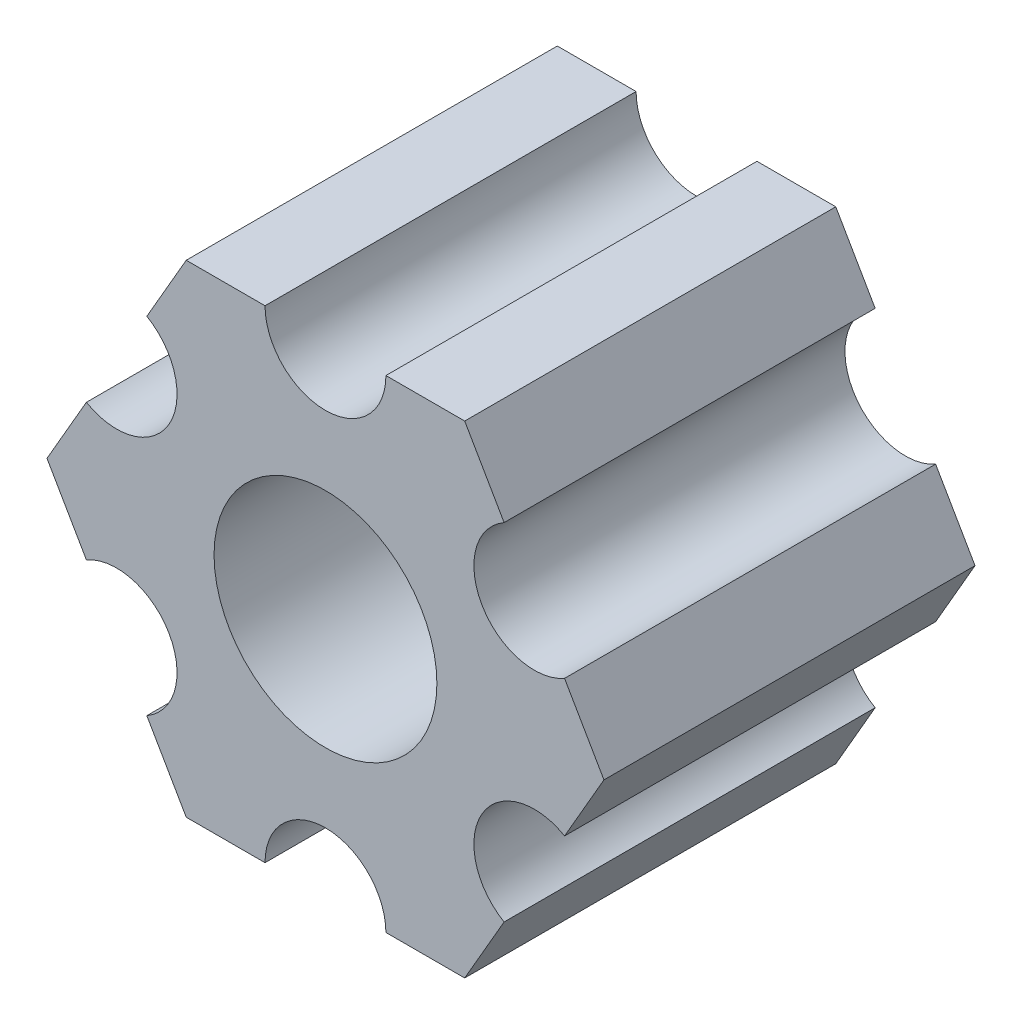
ISO-10303-21;
HEADER;
FILE_DESCRIPTION(('STEP AP214'),'2;1');
FILE_NAME('part.step','',(''),(''),'','','');
FILE_SCHEMA(('AUTOMOTIVE_DESIGN { 1 0 10303 214 1 1 1 1 }'));
ENDSEC;
DATA;
#1=APPLICATION_CONTEXT('core data for automotive mechanical design processes');
#2=APPLICATION_PROTOCOL_DEFINITION('international standard','automotive_design',2000,#1);
#3=PRODUCT_CONTEXT('',#1,'mechanical');
#4=PRODUCT('Part','Part','',(#3));
#5=PRODUCT_RELATED_PRODUCT_CATEGORY('part','',(#4));
#6=PRODUCT_DEFINITION_FORMATION('','',#4);
#7=PRODUCT_DEFINITION_CONTEXT('part definition',#1,'design');
#8=PRODUCT_DEFINITION('design','',#6,#7);
#9=PRODUCT_DEFINITION_SHAPE('','',#8);
#10=(LENGTH_UNIT() NAMED_UNIT(*) SI_UNIT(.MILLI.,.METRE.));
#11=(NAMED_UNIT(*) PLANE_ANGLE_UNIT() SI_UNIT($,.RADIAN.));
#12=(NAMED_UNIT(*) SI_UNIT($,.STERADIAN.) SOLID_ANGLE_UNIT());
#13=UNCERTAINTY_MEASURE_WITH_UNIT(LENGTH_MEASURE(1.E-05),#10,'distance_accuracy_value','');
#14=(GEOMETRIC_REPRESENTATION_CONTEXT(3) GLOBAL_UNCERTAINTY_ASSIGNED_CONTEXT((#13)) GLOBAL_UNIT_ASSIGNED_CONTEXT((#10,
#11,#12)) REPRESENTATION_CONTEXT('',''));
#15=CARTESIAN_POINT('',(0.,0.,0.));
#16=DIRECTION('',(0.,0.,1.));
#17=DIRECTION('',(1.,0.,0.));
#18=AXIS2_PLACEMENT_3D('',#15,#16,#17);
#19=CARTESIAN_POINT('',(5.49926131403118,-3.175,9.77));
#20=DIRECTION('',(0.,0.,-1.));
#21=DIRECTION('',(-1.,0.,0.));
#22=AXIS2_PLACEMENT_3D('',#19,#20,#21);
#23=CYLINDRICAL_SURFACE('',#22,1.59130995915342);
#24=CARTESIAN_POINT('',(5.49926131403118,-3.175,0.));
#25=DIRECTION('',(0.,0.,1.));
#26=DIRECTION('',(1.,0.,0.));
#27=AXIS2_PLACEMENT_3D('',#24,#25,#26);
#28=CIRCLE('',#27,1.59130995915342);
#29=CARTESIAN_POINT('',(6.2949162936079,-1.79688515007796,0.));
#30=VERTEX_POINT('',#29);
#31=CARTESIAN_POINT('',(4.70360633445448,-4.55311484992204,0.));
#32=VERTEX_POINT('',#31);
#33=EDGE_CURVE('E202',#30,#32,#28,.T.);
#34=ORIENTED_EDGE('',*,*,#33,.F.);
#35=DIRECTION('',(0.,0.,-1.));
#36=VECTOR('',#35,1.);
#37=CARTESIAN_POINT('',(6.2949162936079,-1.79688515007796,9.77));
#38=LINE('',#37,#36);
#39=CARTESIAN_POINT('',(6.2949162936079,-1.79688515007796,9.77));
#40=VERTEX_POINT('',#39);
#41=EDGE_CURVE('E13',#40,#30,#38,.T.);
#42=ORIENTED_EDGE('',*,*,#41,.F.);
#43=CARTESIAN_POINT('',(5.49926131403118,-3.175,9.77));
#44=DIRECTION('',(0.,0.,1.));
#45=DIRECTION('',(1.,0.,0.));
#46=AXIS2_PLACEMENT_3D('',#43,#44,#45);
#47=CIRCLE('',#46,1.59130995915342);
#48=CARTESIAN_POINT('',(4.70360633445448,-4.55311484992204,9.77));
#49=VERTEX_POINT('',#48);
#50=EDGE_CURVE('E253',#40,#49,#47,.T.);
#51=ORIENTED_EDGE('',*,*,#50,.T.);
#52=DIRECTION('',(0.,0.,-1.));
#53=VECTOR('',#52,1.);
#54=CARTESIAN_POINT('',(4.70360633445448,-4.55311484992204,9.77));
#55=LINE('',#54,#53);
#56=EDGE_CURVE('E48',#49,#32,#55,.T.);
#57=ORIENTED_EDGE('',*,*,#56,.T.);
#58=EDGE_LOOP('',(#34,#42,#51,#57));
#59=FACE_BOUND('',#58,.T.);
#60=ADVANCED_FACE('F45',(#59),#23,.F.);
#61=CARTESIAN_POINT('',(7.33234841870824,0.,9.77));
#62=DIRECTION('',(0.866025403784439,-0.499999999999999,0.));
#63=DIRECTION('',(0.499999999999999,0.866025403784439,0.));
#64=AXIS2_PLACEMENT_3D('',#61,#62,#63);
#65=PLANE('',#64);
#66=DIRECTION('',(-0.499999999999999,-0.866025403784439,0.));
#67=VECTOR('',#66,1.);
#68=CARTESIAN_POINT('',(7.33234841870824,0.,0.));
#69=LINE('',#68,#67);
#70=CARTESIAN_POINT('',(7.33234841870824,0.,0.));
#71=VERTEX_POINT('',#70);
#72=EDGE_CURVE('E251',#71,#30,#69,.T.);
#73=ORIENTED_EDGE('',*,*,#72,.F.);
#74=DIRECTION('',(0.,0.,-1.));
#75=VECTOR('',#74,1.);
#76=CARTESIAN_POINT('',(7.33234841870824,0.,9.77));
#77=LINE('',#76,#75);
#78=CARTESIAN_POINT('',(7.33234841870824,0.,9.77));
#79=VERTEX_POINT('',#78);
#80=EDGE_CURVE('E54',#79,#71,#77,.T.);
#81=ORIENTED_EDGE('',*,*,#80,.F.);
#82=DIRECTION('',(-0.499999999999999,-0.866025403784439,0.));
#83=VECTOR('',#82,1.);
#84=CARTESIAN_POINT('',(7.33234841870824,0.,9.77));
#85=LINE('',#84,#83);
#86=EDGE_CURVE('E192',#79,#40,#85,.T.);
#87=ORIENTED_EDGE('',*,*,#86,.T.);
#88=ORIENTED_EDGE('',*,*,#41,.T.);
#89=EDGE_LOOP('',(#73,#81,#87,#88));
#90=FACE_BOUND('',#89,.T.);
#91=ADVANCED_FACE('F285',(#90),#65,.T.);
#92=CARTESIAN_POINT('',(6.2949162936079,1.79688515007796,9.77));
#93=DIRECTION('',(0.866025403784439,0.499999999999999,0.));
#94=DIRECTION('',(-0.499999999999999,0.866025403784439,0.));
#95=AXIS2_PLACEMENT_3D('',#92,#93,#94);
#96=PLANE('',#95);
#97=DIRECTION('',(0.499999999999999,-0.866025403784439,0.));
#98=VECTOR('',#97,1.);
#99=CARTESIAN_POINT('',(6.2949162936079,1.79688515007796,0.));
#100=LINE('',#99,#98);
#101=CARTESIAN_POINT('',(6.2949162936079,1.79688515007796,0.));
#102=VERTEX_POINT('',#101);
#103=EDGE_CURVE('E179',#102,#71,#100,.T.);
#104=ORIENTED_EDGE('',*,*,#103,.F.);
#105=DIRECTION('',(0.,0.,-1.));
#106=VECTOR('',#105,1.);
#107=CARTESIAN_POINT('',(6.2949162936079,1.79688515007796,9.77));
#108=LINE('',#107,#106);
#109=CARTESIAN_POINT('',(6.2949162936079,1.79688515007796,9.77));
#110=VERTEX_POINT('',#109);
#111=EDGE_CURVE('E174',#110,#102,#108,.T.);
#112=ORIENTED_EDGE('',*,*,#111,.F.);
#113=DIRECTION('',(0.499999999999999,-0.866025403784439,0.));
#114=VECTOR('',#113,1.);
#115=CARTESIAN_POINT('',(6.2949162936079,1.79688515007796,9.77));
#116=LINE('',#115,#114);
#117=EDGE_CURVE('E177',#110,#79,#116,.T.);
#118=ORIENTED_EDGE('',*,*,#117,.T.);
#119=ORIENTED_EDGE('',*,*,#80,.T.);
#120=EDGE_LOOP('',(#104,#112,#118,#119));
#121=FACE_BOUND('',#120,.T.);
#122=ADVANCED_FACE('F176',(#121),#96,.T.);
#123=CARTESIAN_POINT('',(5.49926131403119,3.175,9.77));
#124=DIRECTION('',(0.,0.,-1.));
#125=DIRECTION('',(-1.,0.,0.));
#126=AXIS2_PLACEMENT_3D('',#123,#124,#125);
#127=CYLINDRICAL_SURFACE('',#126,1.59130995915342);
#128=CARTESIAN_POINT('',(5.49926131403119,3.175,0.));
#129=DIRECTION('',(0.,0.,1.));
#130=DIRECTION('',(1.,0.,0.));
#131=AXIS2_PLACEMENT_3D('',#128,#129,#130);
#132=CIRCLE('',#131,1.59130995915342);
#133=CARTESIAN_POINT('',(4.70360633445448,4.55311484992204,0.));
#134=VERTEX_POINT('',#133);
#135=EDGE_CURVE('E248',#134,#102,#132,.T.);
#136=ORIENTED_EDGE('',*,*,#135,.F.);
#137=DIRECTION('',(0.,0.,-1.));
#138=VECTOR('',#137,1.);
#139=CARTESIAN_POINT('',(4.70360633445448,4.55311484992204,9.77));
#140=LINE('',#139,#138);
#141=CARTESIAN_POINT('',(4.70360633445448,4.55311484992204,9.77));
#142=VERTEX_POINT('',#141);
#143=EDGE_CURVE('E184',#142,#134,#140,.T.);
#144=ORIENTED_EDGE('',*,*,#143,.F.);
#145=CARTESIAN_POINT('',(5.49926131403119,3.175,9.77));
#146=DIRECTION('',(0.,0.,1.));
#147=DIRECTION('',(1.,0.,0.));
#148=AXIS2_PLACEMENT_3D('',#145,#146,#147);
#149=CIRCLE('',#148,1.59130995915342);
#150=EDGE_CURVE('E190',#142,#110,#149,.T.);
#151=ORIENTED_EDGE('',*,*,#150,.T.);
#152=ORIENTED_EDGE('',*,*,#111,.T.);
#153=EDGE_LOOP('',(#136,#144,#151,#152));
#154=FACE_BOUND('',#153,.T.);
#155=ADVANCED_FACE('F194',(#154),#127,.F.);
#156=CARTESIAN_POINT('',(3.66617420935412,6.35,9.77));
#157=DIRECTION('',(0.866025403784438,0.5,0.));
#158=DIRECTION('',(-0.5,0.866025403784438,0.));
#159=AXIS2_PLACEMENT_3D('',#156,#157,#158);
#160=PLANE('',#159);
#161=DIRECTION('',(0.5,-0.866025403784438,0.));
#162=VECTOR('',#161,1.);
#163=CARTESIAN_POINT('',(3.66617420935412,6.35,0.));
#164=LINE('',#163,#162);
#165=CARTESIAN_POINT('',(3.66617420935412,6.35,0.));
#166=VERTEX_POINT('',#165);
#167=EDGE_CURVE('E245',#166,#134,#164,.T.);
#168=ORIENTED_EDGE('',*,*,#167,.F.);
#169=DIRECTION('',(0.,0.,-1.));
#170=VECTOR('',#169,1.);
#171=CARTESIAN_POINT('',(3.66617420935412,6.35,9.77));
#172=LINE('',#171,#170);
#173=CARTESIAN_POINT('',(3.66617420935412,6.35,9.77));
#174=VERTEX_POINT('',#173);
#175=EDGE_CURVE('E257',#174,#166,#172,.T.);
#176=ORIENTED_EDGE('',*,*,#175,.F.);
#177=DIRECTION('',(0.5,-0.866025403784438,0.));
#178=VECTOR('',#177,1.);
#179=CARTESIAN_POINT('',(3.66617420935412,6.35,9.77));
#180=LINE('',#179,#178);
#181=EDGE_CURVE('E195',#174,#142,#180,.T.);
#182=ORIENTED_EDGE('',*,*,#181,.T.);
#183=ORIENTED_EDGE('',*,*,#143,.T.);
#184=EDGE_LOOP('',(#168,#176,#182,#183));
#185=FACE_BOUND('',#184,.T.);
#186=ADVANCED_FACE('F298',(#185),#160,.T.);
#187=CARTESIAN_POINT('',(1.59130995915343,6.35,9.77));
#188=DIRECTION('',(0.,1.,0.));
#189=DIRECTION('',(0.,0.,1.));
#190=AXIS2_PLACEMENT_3D('',#187,#188,#189);
#191=PLANE('',#190);
#192=DIRECTION('',(1.,0.,0.));
#193=VECTOR('',#192,1.);
#194=CARTESIAN_POINT('',(1.59130995915343,6.35,0.));
#195=LINE('',#194,#193);
#196=CARTESIAN_POINT('',(1.59130995915343,6.35,0.));
#197=VERTEX_POINT('',#196);
#198=EDGE_CURVE('E242',#197,#166,#195,.T.);
#199=ORIENTED_EDGE('',*,*,#198,.F.);
#200=DIRECTION('',(0.,0.,-1.));
#201=VECTOR('',#200,1.);
#202=CARTESIAN_POINT('',(1.59130995915343,6.35,9.77));
#203=LINE('',#202,#201);
#204=CARTESIAN_POINT('',(1.59130995915343,6.35,9.77));
#205=VERTEX_POINT('',#204);
#206=EDGE_CURVE('E259',#205,#197,#203,.T.);
#207=ORIENTED_EDGE('',*,*,#206,.F.);
#208=DIRECTION('',(1.,0.,0.));
#209=VECTOR('',#208,1.);
#210=CARTESIAN_POINT('',(1.59130995915343,6.35,9.77));
#211=LINE('',#210,#209);
#212=EDGE_CURVE('E197',#205,#174,#211,.T.);
#213=ORIENTED_EDGE('',*,*,#212,.T.);
#214=ORIENTED_EDGE('',*,*,#175,.T.);
#215=EDGE_LOOP('',(#199,#207,#213,#214));
#216=FACE_BOUND('',#215,.T.);
#217=ADVANCED_FACE('F301',(#216),#191,.T.);
#218=CARTESIAN_POINT('',(0.,6.35,9.77));
#219=DIRECTION('',(0.,0.,-1.));
#220=DIRECTION('',(-1.,0.,0.));
#221=AXIS2_PLACEMENT_3D('',#218,#219,#220);
#222=CYLINDRICAL_SURFACE('',#221,1.59130995915342);
#223=CARTESIAN_POINT('',(0.,6.35,0.));
#224=DIRECTION('',(0.,0.,1.));
#225=DIRECTION('',(1.,0.,0.));
#226=AXIS2_PLACEMENT_3D('',#223,#224,#225);
#227=CIRCLE('',#226,1.59130995915342);
#228=CARTESIAN_POINT('',(-1.59130995915342,6.35,0.));
#229=VERTEX_POINT('',#228);
#230=EDGE_CURVE('E239',#229,#197,#227,.T.);
#231=ORIENTED_EDGE('',*,*,#230,.F.);
#232=DIRECTION('',(0.,0.,-1.));
#233=VECTOR('',#232,1.);
#234=CARTESIAN_POINT('',(-1.59130995915342,6.35,9.77));
#235=LINE('',#234,#233);
#236=CARTESIAN_POINT('',(-1.59130995915342,6.35,9.77));
#237=VERTEX_POINT('',#236);
#238=EDGE_CURVE('E261',#237,#229,#235,.T.);
#239=ORIENTED_EDGE('',*,*,#238,.F.);
#240=CARTESIAN_POINT('',(0.,6.35,9.77));
#241=DIRECTION('',(0.,0.,1.));
#242=DIRECTION('',(1.,0.,0.));
#243=AXIS2_PLACEMENT_3D('',#240,#241,#242);
#244=CIRCLE('',#243,1.59130995915342);
#245=EDGE_CURVE('E406',#237,#205,#244,.T.);
#246=ORIENTED_EDGE('',*,*,#245,.T.);
#247=ORIENTED_EDGE('',*,*,#206,.T.);
#248=EDGE_LOOP('',(#231,#239,#246,#247));
#249=FACE_BOUND('',#248,.T.);
#250=ADVANCED_FACE('F305',(#249),#222,.F.);
#251=CARTESIAN_POINT('',(-3.66617420935413,6.35,9.77));
#252=DIRECTION('',(0.,1.,0.));
#253=DIRECTION('',(0.,0.,1.));
#254=AXIS2_PLACEMENT_3D('',#251,#252,#253);
#255=PLANE('',#254);
#256=DIRECTION('',(1.,0.,0.));
#257=VECTOR('',#256,1.);
#258=CARTESIAN_POINT('',(-3.66617420935413,6.35,0.));
#259=LINE('',#258,#257);
#260=CARTESIAN_POINT('',(-3.66617420935413,6.35,0.));
#261=VERTEX_POINT('',#260);
#262=EDGE_CURVE('E236',#261,#229,#259,.T.);
#263=ORIENTED_EDGE('',*,*,#262,.F.);
#264=DIRECTION('',(0.,0.,-1.));
#265=VECTOR('',#264,1.);
#266=CARTESIAN_POINT('',(-3.66617420935413,6.35,9.77));
#267=LINE('',#266,#265);
#268=CARTESIAN_POINT('',(-3.66617420935413,6.35,9.77));
#269=VERTEX_POINT('',#268);
#270=EDGE_CURVE('E263',#269,#261,#267,.T.);
#271=ORIENTED_EDGE('',*,*,#270,.F.);
#272=DIRECTION('',(1.,0.,0.));
#273=VECTOR('',#272,1.);
#274=CARTESIAN_POINT('',(-3.66617420935413,6.35,9.77));
#275=LINE('',#274,#273);
#276=EDGE_CURVE('E403',#269,#237,#275,.T.);
#277=ORIENTED_EDGE('',*,*,#276,.T.);
#278=ORIENTED_EDGE('',*,*,#238,.T.);
#279=EDGE_LOOP('',(#263,#271,#277,#278));
#280=FACE_BOUND('',#279,.T.);
#281=ADVANCED_FACE('F309',(#280),#255,.T.);
#282=CARTESIAN_POINT('',(-4.70360633445447,4.55311484992205,9.77));
#283=DIRECTION('',(-0.866025403784439,0.5,0.));
#284=DIRECTION('',(-0.5,-0.866025403784439,0.));
#285=AXIS2_PLACEMENT_3D('',#282,#283,#284);
#286=PLANE('',#285);
#287=DIRECTION('',(0.5,0.866025403784439,0.));
#288=VECTOR('',#287,1.);
#289=CARTESIAN_POINT('',(-4.70360633445447,4.55311484992205,0.));
#290=LINE('',#289,#288);
#291=CARTESIAN_POINT('',(-4.70360633445447,4.55311484992205,0.));
#292=VERTEX_POINT('',#291);
#293=EDGE_CURVE('E233',#292,#261,#290,.T.);
#294=ORIENTED_EDGE('',*,*,#293,.F.);
#295=DIRECTION('',(0.,0.,-1.));
#296=VECTOR('',#295,1.);
#297=CARTESIAN_POINT('',(-4.70360633445447,4.55311484992205,9.77));
#298=LINE('',#297,#296);
#299=CARTESIAN_POINT('',(-4.70360633445447,4.55311484992205,9.77));
#300=VERTEX_POINT('',#299);
#301=EDGE_CURVE('E265',#300,#292,#298,.T.);
#302=ORIENTED_EDGE('',*,*,#301,.F.);
#303=DIRECTION('',(0.5,0.866025403784439,0.));
#304=VECTOR('',#303,1.);
#305=CARTESIAN_POINT('',(-4.70360633445447,4.55311484992205,9.77));
#306=LINE('',#305,#304);
#307=EDGE_CURVE('E400',#300,#269,#306,.T.);
#308=ORIENTED_EDGE('',*,*,#307,.T.);
#309=ORIENTED_EDGE('',*,*,#270,.T.);
#310=EDGE_LOOP('',(#294,#302,#308,#309));
#311=FACE_BOUND('',#310,.T.);
#312=ADVANCED_FACE('F313',(#311),#286,.T.);
#313=CARTESIAN_POINT('',(-5.49926131403118,3.175,9.77));
#314=DIRECTION('',(0.,0.,-1.));
#315=DIRECTION('',(-1.,0.,0.));
#316=AXIS2_PLACEMENT_3D('',#313,#314,#315);
#317=CYLINDRICAL_SURFACE('',#316,1.59130995915342);
#318=CARTESIAN_POINT('',(-5.49926131403118,3.175,0.));
#319=DIRECTION('',(0.,0.,1.));
#320=DIRECTION('',(1.,0.,0.));
#321=AXIS2_PLACEMENT_3D('',#318,#319,#320);
#322=CIRCLE('',#321,1.59130995915342);
#323=CARTESIAN_POINT('',(-6.29491629360789,1.79688515007796,0.));
#324=VERTEX_POINT('',#323);
#325=EDGE_CURVE('E230',#324,#292,#322,.T.);
#326=ORIENTED_EDGE('',*,*,#325,.F.);
#327=DIRECTION('',(0.,0.,-1.));
#328=VECTOR('',#327,1.);
#329=CARTESIAN_POINT('',(-6.29491629360789,1.79688515007796,9.77));
#330=LINE('',#329,#328);
#331=CARTESIAN_POINT('',(-6.29491629360789,1.79688515007796,9.77));
#332=VERTEX_POINT('',#331);
#333=EDGE_CURVE('E267',#332,#324,#330,.T.);
#334=ORIENTED_EDGE('',*,*,#333,.F.);
#335=CARTESIAN_POINT('',(-5.49926131403118,3.175,9.77));
#336=DIRECTION('',(0.,0.,1.));
#337=DIRECTION('',(1.,0.,0.));
#338=AXIS2_PLACEMENT_3D('',#335,#336,#337);
#339=CIRCLE('',#338,1.59130995915342);
#340=EDGE_CURVE('E397',#332,#300,#339,.T.);
#341=ORIENTED_EDGE('',*,*,#340,.T.);
#342=ORIENTED_EDGE('',*,*,#301,.T.);
#343=EDGE_LOOP('',(#326,#334,#341,#342));
#344=FACE_BOUND('',#343,.T.);
#345=ADVANCED_FACE('F317',(#344),#317,.F.);
#346=CARTESIAN_POINT('',(-7.33234841870825,0.,9.77));
#347=DIRECTION('',(-0.866025403784438,0.5,0.));
#348=DIRECTION('',(-0.5,-0.866025403784438,0.));
#349=AXIS2_PLACEMENT_3D('',#346,#347,#348);
#350=PLANE('',#349);
#351=DIRECTION('',(0.5,0.866025403784438,0.));
#352=VECTOR('',#351,1.);
#353=CARTESIAN_POINT('',(-7.33234841870825,0.,0.));
#354=LINE('',#353,#352);
#355=CARTESIAN_POINT('',(-7.33234841870825,0.,0.));
#356=VERTEX_POINT('',#355);
#357=EDGE_CURVE('E227',#356,#324,#354,.T.);
#358=ORIENTED_EDGE('',*,*,#357,.F.);
#359=DIRECTION('',(0.,0.,-1.));
#360=VECTOR('',#359,1.);
#361=CARTESIAN_POINT('',(-7.33234841870825,0.,9.77));
#362=LINE('',#361,#360);
#363=CARTESIAN_POINT('',(-7.33234841870825,0.,9.77));
#364=VERTEX_POINT('',#363);
#365=EDGE_CURVE('E269',#364,#356,#362,.T.);
#366=ORIENTED_EDGE('',*,*,#365,.F.);
#367=DIRECTION('',(0.5,0.866025403784438,0.));
#368=VECTOR('',#367,1.);
#369=CARTESIAN_POINT('',(-7.33234841870825,0.,9.77));
#370=LINE('',#369,#368);
#371=EDGE_CURVE('E394',#364,#332,#370,.T.);
#372=ORIENTED_EDGE('',*,*,#371,.T.);
#373=ORIENTED_EDGE('',*,*,#333,.T.);
#374=EDGE_LOOP('',(#358,#366,#372,#373));
#375=FACE_BOUND('',#374,.T.);
#376=ADVANCED_FACE('F321',(#375),#350,.T.);
#377=CARTESIAN_POINT('',(-6.2949162936079,-1.79688515007796,9.77));
#378=DIRECTION('',(-0.866025403784439,-0.5,0.));
#379=DIRECTION('',(0.5,-0.866025403784439,0.));
#380=AXIS2_PLACEMENT_3D('',#377,#378,#379);
#381=PLANE('',#380);
#382=DIRECTION('',(-0.5,0.866025403784439,0.));
#383=VECTOR('',#382,1.);
#384=CARTESIAN_POINT('',(-6.2949162936079,-1.79688515007796,0.));
#385=LINE('',#384,#383);
#386=CARTESIAN_POINT('',(-6.2949162936079,-1.79688515007796,0.));
#387=VERTEX_POINT('',#386);
#388=EDGE_CURVE('E224',#387,#356,#385,.T.);
#389=ORIENTED_EDGE('',*,*,#388,.F.);
#390=DIRECTION('',(0.,0.,-1.));
#391=VECTOR('',#390,1.);
#392=CARTESIAN_POINT('',(-6.2949162936079,-1.79688515007796,9.77));
#393=LINE('',#392,#391);
#394=CARTESIAN_POINT('',(-6.2949162936079,-1.79688515007796,9.77));
#395=VERTEX_POINT('',#394);
#396=EDGE_CURVE('E271',#395,#387,#393,.T.);
#397=ORIENTED_EDGE('',*,*,#396,.F.);
#398=DIRECTION('',(-0.5,0.866025403784439,0.));
#399=VECTOR('',#398,1.);
#400=CARTESIAN_POINT('',(-6.2949162936079,-1.79688515007796,9.77));
#401=LINE('',#400,#399);
#402=EDGE_CURVE('E391',#395,#364,#401,.T.);
#403=ORIENTED_EDGE('',*,*,#402,.T.);
#404=ORIENTED_EDGE('',*,*,#365,.T.);
#405=EDGE_LOOP('',(#389,#397,#403,#404));
#406=FACE_BOUND('',#405,.T.);
#407=ADVANCED_FACE('F325',(#406),#381,.T.);
#408=CARTESIAN_POINT('',(-5.49926131403119,-3.175,9.77));
#409=DIRECTION('',(0.,0.,-1.));
#410=DIRECTION('',(-1.,0.,0.));
#411=AXIS2_PLACEMENT_3D('',#408,#409,#410);
#412=CYLINDRICAL_SURFACE('',#411,1.59130995915342);
#413=CARTESIAN_POINT('',(-5.49926131403119,-3.175,0.));
#414=DIRECTION('',(0.,0.,1.));
#415=DIRECTION('',(1.,0.,0.));
#416=AXIS2_PLACEMENT_3D('',#413,#414,#415);
#417=CIRCLE('',#416,1.59130995915342);
#418=CARTESIAN_POINT('',(-4.70360633445448,-4.55311484992204,0.));
#419=VERTEX_POINT('',#418);
#420=EDGE_CURVE('E221',#419,#387,#417,.T.);
#421=ORIENTED_EDGE('',*,*,#420,.F.);
#422=DIRECTION('',(0.,0.,-1.));
#423=VECTOR('',#422,1.);
#424=CARTESIAN_POINT('',(-4.70360633445448,-4.55311484992204,9.77));
#425=LINE('',#424,#423);
#426=CARTESIAN_POINT('',(-4.70360633445448,-4.55311484992204,9.77));
#427=VERTEX_POINT('',#426);
#428=EDGE_CURVE('E273',#427,#419,#425,.T.);
#429=ORIENTED_EDGE('',*,*,#428,.F.);
#430=CARTESIAN_POINT('',(-5.49926131403119,-3.175,9.77));
#431=DIRECTION('',(0.,0.,1.));
#432=DIRECTION('',(1.,0.,0.));
#433=AXIS2_PLACEMENT_3D('',#430,#431,#432);
#434=CIRCLE('',#433,1.59130995915342);
#435=EDGE_CURVE('E388',#427,#395,#434,.T.);
#436=ORIENTED_EDGE('',*,*,#435,.T.);
#437=ORIENTED_EDGE('',*,*,#396,.T.);
#438=EDGE_LOOP('',(#421,#429,#436,#437));
#439=FACE_BOUND('',#438,.T.);
#440=ADVANCED_FACE('F329',(#439),#412,.F.);
#441=CARTESIAN_POINT('',(-3.66617420935412,-6.35,9.77));
#442=DIRECTION('',(-0.866025403784439,-0.5,0.));
#443=DIRECTION('',(0.5,-0.866025403784439,0.));
#444=AXIS2_PLACEMENT_3D('',#441,#442,#443);
#445=PLANE('',#444);
#446=DIRECTION('',(-0.5,0.866025403784439,0.));
#447=VECTOR('',#446,1.);
#448=CARTESIAN_POINT('',(-3.66617420935412,-6.35,0.));
#449=LINE('',#448,#447);
#450=CARTESIAN_POINT('',(-3.66617420935412,-6.35,0.));
#451=VERTEX_POINT('',#450);
#452=EDGE_CURVE('E218',#451,#419,#449,.T.);
#453=ORIENTED_EDGE('',*,*,#452,.F.);
#454=DIRECTION('',(0.,0.,-1.));
#455=VECTOR('',#454,1.);
#456=CARTESIAN_POINT('',(-3.66617420935412,-6.35,9.77));
#457=LINE('',#456,#455);
#458=CARTESIAN_POINT('',(-3.66617420935412,-6.35,9.77));
#459=VERTEX_POINT('',#458);
#460=EDGE_CURVE('E275',#459,#451,#457,.T.);
#461=ORIENTED_EDGE('',*,*,#460,.F.);
#462=DIRECTION('',(-0.5,0.866025403784439,0.));
#463=VECTOR('',#462,1.);
#464=CARTESIAN_POINT('',(-3.66617420935412,-6.35,9.77));
#465=LINE('',#464,#463);
#466=EDGE_CURVE('E385',#459,#427,#465,.T.);
#467=ORIENTED_EDGE('',*,*,#466,.T.);
#468=ORIENTED_EDGE('',*,*,#428,.T.);
#469=EDGE_LOOP('',(#453,#461,#467,#468));
#470=FACE_BOUND('',#469,.T.);
#471=ADVANCED_FACE('F333',(#470),#445,.T.);
#472=CARTESIAN_POINT('',(-1.59130995915342,-6.35,9.77));
#473=DIRECTION('',(0.,-1.,0.));
#474=DIRECTION('',(0.,0.,-1.));
#475=AXIS2_PLACEMENT_3D('',#472,#473,#474);
#476=PLANE('',#475);
#477=DIRECTION('',(-1.,0.,0.));
#478=VECTOR('',#477,1.);
#479=CARTESIAN_POINT('',(-1.59130995915342,-6.35,0.));
#480=LINE('',#479,#478);
#481=CARTESIAN_POINT('',(-1.59130995915342,-6.35,0.));
#482=VERTEX_POINT('',#481);
#483=EDGE_CURVE('E215',#482,#451,#480,.T.);
#484=ORIENTED_EDGE('',*,*,#483,.F.);
#485=DIRECTION('',(0.,0.,-1.));
#486=VECTOR('',#485,1.);
#487=CARTESIAN_POINT('',(-1.59130995915342,-6.35,9.77));
#488=LINE('',#487,#486);
#489=CARTESIAN_POINT('',(-1.59130995915342,-6.35,9.77));
#490=VERTEX_POINT('',#489);
#491=EDGE_CURVE('E277',#490,#482,#488,.T.);
#492=ORIENTED_EDGE('',*,*,#491,.F.);
#493=DIRECTION('',(-1.,0.,0.));
#494=VECTOR('',#493,1.);
#495=CARTESIAN_POINT('',(-1.59130995915342,-6.35,9.77));
#496=LINE('',#495,#494);
#497=EDGE_CURVE('E382',#490,#459,#496,.T.);
#498=ORIENTED_EDGE('',*,*,#497,.T.);
#499=ORIENTED_EDGE('',*,*,#460,.T.);
#500=EDGE_LOOP('',(#484,#492,#498,#499));
#501=FACE_BOUND('',#500,.T.);
#502=ADVANCED_FACE('F337',(#501),#476,.T.);
#503=CARTESIAN_POINT('',(0.,-6.35,9.77));
#504=DIRECTION('',(0.,0.,-1.));
#505=DIRECTION('',(-1.,0.,0.));
#506=AXIS2_PLACEMENT_3D('',#503,#504,#505);
#507=CYLINDRICAL_SURFACE('',#506,1.59130995915342);
#508=CARTESIAN_POINT('',(0.,-6.35,0.));
#509=DIRECTION('',(0.,0.,1.));
#510=DIRECTION('',(1.,0.,0.));
#511=AXIS2_PLACEMENT_3D('',#508,#509,#510);
#512=CIRCLE('',#511,1.59130995915342);
#513=CARTESIAN_POINT('',(1.59130995915342,-6.35,0.));
#514=VERTEX_POINT('',#513);
#515=EDGE_CURVE('E212',#514,#482,#512,.T.);
#516=ORIENTED_EDGE('',*,*,#515,.F.);
#517=DIRECTION('',(0.,0.,-1.));
#518=VECTOR('',#517,1.);
#519=CARTESIAN_POINT('',(1.59130995915342,-6.35,9.77));
#520=LINE('',#519,#518);
#521=CARTESIAN_POINT('',(1.59130995915342,-6.35,9.77));
#522=VERTEX_POINT('',#521);
#523=EDGE_CURVE('E279',#522,#514,#520,.T.);
#524=ORIENTED_EDGE('',*,*,#523,.F.);
#525=CARTESIAN_POINT('',(0.,-6.35,9.77));
#526=DIRECTION('',(0.,0.,1.));
#527=DIRECTION('',(1.,0.,0.));
#528=AXIS2_PLACEMENT_3D('',#525,#526,#527);
#529=CIRCLE('',#528,1.59130995915342);
#530=EDGE_CURVE('E379',#522,#490,#529,.T.);
#531=ORIENTED_EDGE('',*,*,#530,.T.);
#532=ORIENTED_EDGE('',*,*,#491,.T.);
#533=EDGE_LOOP('',(#516,#524,#531,#532));
#534=FACE_BOUND('',#533,.T.);
#535=ADVANCED_FACE('F341',(#534),#507,.F.);
#536=CARTESIAN_POINT('',(3.66617420935413,-6.35,9.77));
#537=DIRECTION('',(0.,-1.,0.));
#538=DIRECTION('',(0.,0.,-1.));
#539=AXIS2_PLACEMENT_3D('',#536,#537,#538);
#540=PLANE('',#539);
#541=DIRECTION('',(-1.,0.,0.));
#542=VECTOR('',#541,1.);
#543=CARTESIAN_POINT('',(3.66617420935413,-6.35,0.));
#544=LINE('',#543,#542);
#545=CARTESIAN_POINT('',(3.66617420935413,-6.35,0.));
#546=VERTEX_POINT('',#545);
#547=EDGE_CURVE('E209',#546,#514,#544,.T.);
#548=ORIENTED_EDGE('',*,*,#547,.F.);
#549=DIRECTION('',(0.,0.,-1.));
#550=VECTOR('',#549,1.);
#551=CARTESIAN_POINT('',(3.66617420935413,-6.35,9.77));
#552=LINE('',#551,#550);
#553=CARTESIAN_POINT('',(3.66617420935413,-6.35,9.77));
#554=VERTEX_POINT('',#553);
#555=EDGE_CURVE('E280',#554,#546,#552,.T.);
#556=ORIENTED_EDGE('',*,*,#555,.F.);
#557=DIRECTION('',(-1.,0.,0.));
#558=VECTOR('',#557,1.);
#559=CARTESIAN_POINT('',(3.66617420935413,-6.35,9.77));
#560=LINE('',#559,#558);
#561=EDGE_CURVE('E376',#554,#522,#560,.T.);
#562=ORIENTED_EDGE('',*,*,#561,.T.);
#563=ORIENTED_EDGE('',*,*,#523,.T.);
#564=EDGE_LOOP('',(#548,#556,#562,#563));
#565=FACE_BOUND('',#564,.T.);
#566=ADVANCED_FACE('F345',(#565),#540,.T.);
#567=CARTESIAN_POINT('',(4.70360633445448,-4.55311484992204,9.77));
#568=DIRECTION('',(0.866025403784438,-0.500000000000001,0.));
#569=DIRECTION('',(0.500000000000001,0.866025403784438,0.));
#570=AXIS2_PLACEMENT_3D('',#567,#568,#569);
#571=PLANE('',#570);
#572=DIRECTION('',(-0.500000000000001,-0.866025403784438,0.));
#573=VECTOR('',#572,1.);
#574=CARTESIAN_POINT('',(4.70360633445448,-4.55311484992204,0.));
#575=LINE('',#574,#573);
#576=EDGE_CURVE('E205',#32,#546,#575,.T.);
#577=ORIENTED_EDGE('',*,*,#576,.F.);
#578=ORIENTED_EDGE('',*,*,#56,.F.);
#579=DIRECTION('',(-0.500000000000001,-0.866025403784438,0.));
#580=VECTOR('',#579,1.);
#581=CARTESIAN_POINT('',(4.70360633445448,-4.55311484992204,9.77));
#582=LINE('',#581,#580);
#583=EDGE_CURVE('E374',#49,#554,#582,.T.);
#584=ORIENTED_EDGE('',*,*,#583,.T.);
#585=ORIENTED_EDGE('',*,*,#555,.T.);
#586=EDGE_LOOP('',(#577,#578,#584,#585));
#587=FACE_BOUND('',#586,.T.);
#588=ADVANCED_FACE('F282',(#587),#571,.T.);
#589=CARTESIAN_POINT('',(5.49926131403118,-3.175,9.77));
#590=DIRECTION('',(0.,0.,1.));
#591=DIRECTION('',(1.,0.,0.));
#592=AXIS2_PLACEMENT_3D('',#589,#590,#591);
#593=PLANE('',#592);
#594=CARTESIAN_POINT('',(0.,0.,9.77));
#595=DIRECTION('',(0.,0.,-1.));
#596=DIRECTION('',(1.,0.,0.));
#597=AXIS2_PLACEMENT_3D('',#594,#595,#596);
#598=CIRCLE('',#597,2.9337);
#599=CARTESIAN_POINT('',(2.9337,0.,9.77));
#600=VERTEX_POINT('',#599);
#601=EDGE_CURVE('E206',#600,#600,#598,.T.);
#602=ORIENTED_EDGE('',*,*,#601,.T.);
#603=EDGE_LOOP('',(#602));
#604=FACE_BOUND('',#603,.T.);
#605=ORIENTED_EDGE('',*,*,#50,.F.);
#606=ORIENTED_EDGE('',*,*,#86,.F.);
#607=ORIENTED_EDGE('',*,*,#117,.F.);
#608=ORIENTED_EDGE('',*,*,#150,.F.);
#609=ORIENTED_EDGE('',*,*,#181,.F.);
#610=ORIENTED_EDGE('',*,*,#212,.F.);
#611=ORIENTED_EDGE('',*,*,#245,.F.);
#612=ORIENTED_EDGE('',*,*,#276,.F.);
#613=ORIENTED_EDGE('',*,*,#307,.F.);
#614=ORIENTED_EDGE('',*,*,#340,.F.);
#615=ORIENTED_EDGE('',*,*,#371,.F.);
#616=ORIENTED_EDGE('',*,*,#402,.F.);
#617=ORIENTED_EDGE('',*,*,#435,.F.);
#618=ORIENTED_EDGE('',*,*,#466,.F.);
#619=ORIENTED_EDGE('',*,*,#497,.F.);
#620=ORIENTED_EDGE('',*,*,#530,.F.);
#621=ORIENTED_EDGE('',*,*,#561,.F.);
#622=ORIENTED_EDGE('',*,*,#583,.F.);
#623=EDGE_LOOP('',(#605,#606,#607,#608,#609,#610,#611,#612,#613,#614,#615,#616,#617,#618,#619,
#620,#621,#622));
#624=FACE_BOUND('',#623,.T.);
#625=ADVANCED_FACE('F188',(#604,#624),#593,.T.);
#626=CARTESIAN_POINT('',(5.49926131403118,-3.175,0.));
#627=DIRECTION('',(0.,0.,1.));
#628=DIRECTION('',(1.,0.,0.));
#629=AXIS2_PLACEMENT_3D('',#626,#627,#628);
#630=PLANE('',#629);
#631=CARTESIAN_POINT('',(0.,0.,0.));
#632=DIRECTION('',(0.,0.,-1.));
#633=DIRECTION('',(1.,0.,0.));
#634=AXIS2_PLACEMENT_3D('',#631,#632,#633);
#635=CIRCLE('',#634,2.9337);
#636=CARTESIAN_POINT('',(2.9337,0.,0.));
#637=VERTEX_POINT('',#636);
#638=EDGE_CURVE('E369',#637,#637,#635,.T.);
#639=ORIENTED_EDGE('',*,*,#638,.F.);
#640=EDGE_LOOP('',(#639));
#641=FACE_BOUND('',#640,.T.);
#642=ORIENTED_EDGE('',*,*,#33,.T.);
#643=ORIENTED_EDGE('',*,*,#576,.T.);
#644=ORIENTED_EDGE('',*,*,#547,.T.);
#645=ORIENTED_EDGE('',*,*,#515,.T.);
#646=ORIENTED_EDGE('',*,*,#483,.T.);
#647=ORIENTED_EDGE('',*,*,#452,.T.);
#648=ORIENTED_EDGE('',*,*,#420,.T.);
#649=ORIENTED_EDGE('',*,*,#388,.T.);
#650=ORIENTED_EDGE('',*,*,#357,.T.);
#651=ORIENTED_EDGE('',*,*,#325,.T.);
#652=ORIENTED_EDGE('',*,*,#293,.T.);
#653=ORIENTED_EDGE('',*,*,#262,.T.);
#654=ORIENTED_EDGE('',*,*,#230,.T.);
#655=ORIENTED_EDGE('',*,*,#198,.T.);
#656=ORIENTED_EDGE('',*,*,#167,.T.);
#657=ORIENTED_EDGE('',*,*,#135,.T.);
#658=ORIENTED_EDGE('',*,*,#103,.T.);
#659=ORIENTED_EDGE('',*,*,#72,.T.);
#660=EDGE_LOOP('',(#642,#643,#644,#645,#646,#647,#648,#649,#650,#651,#652,#653,#654,#655,#656,
#657,#658,#659));
#661=FACE_BOUND('',#660,.T.);
#662=ADVANCED_FACE('F284',(#641,#661),#630,.F.);
#663=CARTESIAN_POINT('',(0.,0.,9.77));
#664=DIRECTION('',(0.,0.,-1.));
#665=DIRECTION('',(-1.,0.,0.));
#666=AXIS2_PLACEMENT_3D('',#663,#664,#665);
#667=CYLINDRICAL_SURFACE('',#666,2.9337);
#668=ORIENTED_EDGE('',*,*,#601,.F.);
#669=EDGE_LOOP('',(#668));
#670=FACE_BOUND('',#669,.T.);
#671=ORIENTED_EDGE('',*,*,#638,.T.);
#672=EDGE_LOOP('',(#671));
#673=FACE_BOUND('',#672,.T.);
#674=ADVANCED_FACE('F357',(#670,#673),#667,.F.);
#675=CLOSED_SHELL('',(#60,#91,#122,#155,#186,#217,#250,#281,#312,#345,#376,#407,#440,#471,#502,
#535,#566,#588,#625,#662,#674));
#676=MANIFOLD_SOLID_BREP('B2',#675);
#677=ADVANCED_BREP_SHAPE_REPRESENTATION('',(#18,#676),#14);
#678=SHAPE_DEFINITION_REPRESENTATION(#9,#677);
ENDSEC;
END-ISO-10303-21;
